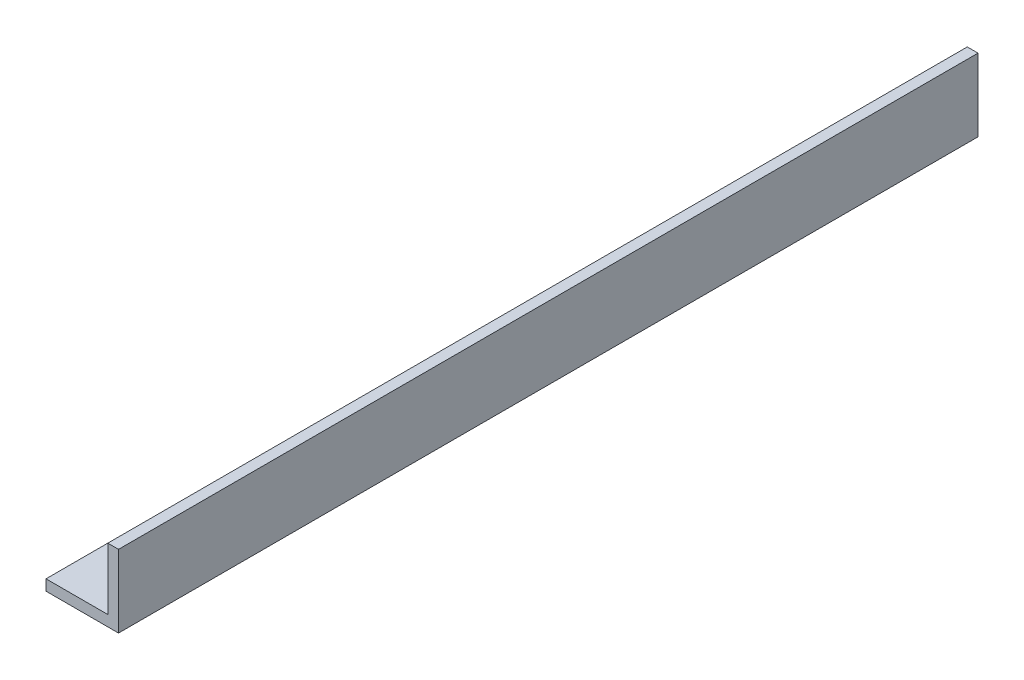
ISO-10303-21;
HEADER;
FILE_DESCRIPTION(('STEP AP214'),'2;1');
FILE_NAME('part.step','',(''),(''),'','','');
FILE_SCHEMA(('AUTOMOTIVE_DESIGN { 1 0 10303 214 1 1 1 1 }'));
ENDSEC;
DATA;
#1=APPLICATION_CONTEXT('core data for automotive mechanical design processes');
#2=APPLICATION_PROTOCOL_DEFINITION('international standard','automotive_design',2000,#1);
#3=PRODUCT_CONTEXT('',#1,'mechanical');
#4=PRODUCT('Part','Part','',(#3));
#5=PRODUCT_RELATED_PRODUCT_CATEGORY('part','',(#4));
#6=PRODUCT_DEFINITION_FORMATION('','',#4);
#7=PRODUCT_DEFINITION_CONTEXT('part definition',#1,'design');
#8=PRODUCT_DEFINITION('design','',#6,#7);
#9=PRODUCT_DEFINITION_SHAPE('','',#8);
#10=(LENGTH_UNIT() NAMED_UNIT(*) SI_UNIT(.MILLI.,.METRE.));
#11=(NAMED_UNIT(*) PLANE_ANGLE_UNIT() SI_UNIT($,.RADIAN.));
#12=(NAMED_UNIT(*) SI_UNIT($,.STERADIAN.) SOLID_ANGLE_UNIT());
#13=UNCERTAINTY_MEASURE_WITH_UNIT(LENGTH_MEASURE(1.E-05),#10,'distance_accuracy_value','');
#14=(GEOMETRIC_REPRESENTATION_CONTEXT(3) GLOBAL_UNCERTAINTY_ASSIGNED_CONTEXT((#13)) GLOBAL_UNIT_ASSIGNED_CONTEXT((#10,
#11,#12)) REPRESENTATION_CONTEXT('',''));
#15=CARTESIAN_POINT('',(0.,0.,0.));
#16=DIRECTION('',(0.,0.,1.));
#17=DIRECTION('',(1.,0.,0.));
#18=AXIS2_PLACEMENT_3D('',#15,#16,#17);
#19=CARTESIAN_POINT('',(0.,4.,320.));
#20=DIRECTION('',(1.,0.,0.));
#21=DIRECTION('',(0.,0.,-1.));
#22=AXIS2_PLACEMENT_3D('',#19,#20,#21);
#23=PLANE('',#22);
#24=DIRECTION('',(0.,-1.,0.));
#25=VECTOR('',#24,1.);
#26=CARTESIAN_POINT('',(0.,4.,0.));
#27=LINE('',#26,#25);
#28=CARTESIAN_POINT('',(0.,4.,0.));
#29=VERTEX_POINT('',#28);
#30=CARTESIAN_POINT('',(0.,0.,0.));
#31=VERTEX_POINT('',#30);
#32=EDGE_CURVE('E117',#29,#31,#27,.T.);
#33=ORIENTED_EDGE('',*,*,#32,.T.);
#34=DIRECTION('',(0.,0.,-1.));
#35=VECTOR('',#34,1.);
#36=CARTESIAN_POINT('',(0.,0.,320.));
#37=LINE('',#36,#35);
#38=CARTESIAN_POINT('',(0.,0.,320.));
#39=VERTEX_POINT('',#38);
#40=EDGE_CURVE('E11',#39,#31,#37,.T.);
#41=ORIENTED_EDGE('',*,*,#40,.F.);
#42=DIRECTION('',(0.,-1.,0.));
#43=VECTOR('',#42,1.);
#44=CARTESIAN_POINT('',(0.,4.,320.));
#45=LINE('',#44,#43);
#46=CARTESIAN_POINT('',(0.,4.,320.));
#47=VERTEX_POINT('',#46);
#48=EDGE_CURVE('E127',#47,#39,#45,.T.);
#49=ORIENTED_EDGE('',*,*,#48,.F.);
#50=DIRECTION('',(0.,0.,-1.));
#51=VECTOR('',#50,1.);
#52=CARTESIAN_POINT('',(0.,4.,320.));
#53=LINE('',#52,#51);
#54=EDGE_CURVE('E113',#47,#29,#53,.T.);
#55=ORIENTED_EDGE('',*,*,#54,.T.);
#56=EDGE_LOOP('',(#33,#41,#49,#55));
#57=FACE_BOUND('',#56,.T.);
#58=ADVANCED_FACE('F33',(#57),#23,.F.);
#59=CARTESIAN_POINT('',(0.,0.,320.));
#60=DIRECTION('',(0.,1.,0.));
#61=DIRECTION('',(0.,0.,1.));
#62=AXIS2_PLACEMENT_3D('',#59,#60,#61);
#63=PLANE('',#62);
#64=DIRECTION('',(1.,0.,0.));
#65=VECTOR('',#64,1.);
#66=CARTESIAN_POINT('',(0.,0.,0.));
#67=LINE('',#66,#65);
#68=CARTESIAN_POINT('',(27.,0.,0.));
#69=VERTEX_POINT('',#68);
#70=EDGE_CURVE('E120',#31,#69,#67,.T.);
#71=ORIENTED_EDGE('',*,*,#70,.T.);
#72=DIRECTION('',(0.,0.,-1.));
#73=VECTOR('',#72,1.);
#74=CARTESIAN_POINT('',(27.,0.,320.));
#75=LINE('',#74,#73);
#76=CARTESIAN_POINT('',(27.,0.,320.));
#77=VERTEX_POINT('',#76);
#78=EDGE_CURVE('E41',#77,#69,#75,.T.);
#79=ORIENTED_EDGE('',*,*,#78,.F.);
#80=DIRECTION('',(1.,0.,0.));
#81=VECTOR('',#80,1.);
#82=CARTESIAN_POINT('',(0.,0.,320.));
#83=LINE('',#82,#81);
#84=EDGE_CURVE('E86',#39,#77,#83,.T.);
#85=ORIENTED_EDGE('',*,*,#84,.F.);
#86=ORIENTED_EDGE('',*,*,#40,.T.);
#87=EDGE_LOOP('',(#71,#79,#85,#86));
#88=FACE_BOUND('',#87,.T.);
#89=ADVANCED_FACE('F151',(#88),#63,.F.);
#90=CARTESIAN_POINT('',(27.,0.,320.));
#91=DIRECTION('',(-1.,0.,0.));
#92=DIRECTION('',(0.,0.,1.));
#93=AXIS2_PLACEMENT_3D('',#90,#91,#92);
#94=PLANE('',#93);
#95=DIRECTION('',(0.,1.,0.));
#96=VECTOR('',#95,1.);
#97=CARTESIAN_POINT('',(27.,0.,0.));
#98=LINE('',#97,#96);
#99=CARTESIAN_POINT('',(27.,27.,0.));
#100=VERTEX_POINT('',#99);
#101=EDGE_CURVE('E122',#69,#100,#98,.T.);
#102=ORIENTED_EDGE('',*,*,#101,.T.);
#103=DIRECTION('',(0.,0.,-1.));
#104=VECTOR('',#103,1.);
#105=CARTESIAN_POINT('',(27.,27.,320.));
#106=LINE('',#105,#104);
#107=CARTESIAN_POINT('',(27.,27.,320.));
#108=VERTEX_POINT('',#107);
#109=EDGE_CURVE('E108',#108,#100,#106,.T.);
#110=ORIENTED_EDGE('',*,*,#109,.F.);
#111=DIRECTION('',(0.,1.,0.));
#112=VECTOR('',#111,1.);
#113=CARTESIAN_POINT('',(27.,0.,320.));
#114=LINE('',#113,#112);
#115=EDGE_CURVE('E99',#77,#108,#114,.T.);
#116=ORIENTED_EDGE('',*,*,#115,.F.);
#117=ORIENTED_EDGE('',*,*,#78,.T.);
#118=EDGE_LOOP('',(#102,#110,#116,#117));
#119=FACE_BOUND('',#118,.T.);
#120=ADVANCED_FACE('F133',(#119),#94,.F.);
#121=CARTESIAN_POINT('',(23.,27.,320.));
#122=DIRECTION('',(0.,-1.,0.));
#123=DIRECTION('',(0.,0.,-1.));
#124=AXIS2_PLACEMENT_3D('',#121,#122,#123);
#125=PLANE('',#124);
#126=DIRECTION('',(-1.,0.,0.));
#127=VECTOR('',#126,1.);
#128=CARTESIAN_POINT('',(23.,27.,0.));
#129=LINE('',#128,#127);
#130=CARTESIAN_POINT('',(23.,27.,0.));
#131=VERTEX_POINT('',#130);
#132=EDGE_CURVE('E107',#100,#131,#129,.T.);
#133=ORIENTED_EDGE('',*,*,#132,.T.);
#134=DIRECTION('',(0.,0.,-1.));
#135=VECTOR('',#134,1.);
#136=CARTESIAN_POINT('',(23.,27.,320.));
#137=LINE('',#136,#135);
#138=CARTESIAN_POINT('',(23.,27.,320.));
#139=VERTEX_POINT('',#138);
#140=EDGE_CURVE('E104',#139,#131,#137,.T.);
#141=ORIENTED_EDGE('',*,*,#140,.F.);
#142=DIRECTION('',(-1.,0.,0.));
#143=VECTOR('',#142,1.);
#144=CARTESIAN_POINT('',(23.,27.,320.));
#145=LINE('',#144,#143);
#146=EDGE_CURVE('E93',#108,#139,#145,.T.);
#147=ORIENTED_EDGE('',*,*,#146,.F.);
#148=ORIENTED_EDGE('',*,*,#109,.T.);
#149=EDGE_LOOP('',(#133,#141,#147,#148));
#150=FACE_BOUND('',#149,.T.);
#151=ADVANCED_FACE('F105',(#150),#125,.F.);
#152=CARTESIAN_POINT('',(23.,4.,320.));
#153=DIRECTION('',(1.,0.,0.));
#154=DIRECTION('',(0.,0.,-1.));
#155=AXIS2_PLACEMENT_3D('',#152,#153,#154);
#156=PLANE('',#155);
#157=DIRECTION('',(0.,-1.,0.));
#158=VECTOR('',#157,1.);
#159=CARTESIAN_POINT('',(23.,4.,0.));
#160=LINE('',#159,#158);
#161=CARTESIAN_POINT('',(23.,4.,0.));
#162=VERTEX_POINT('',#161);
#163=EDGE_CURVE('E72',#131,#162,#160,.T.);
#164=ORIENTED_EDGE('',*,*,#163,.T.);
#165=DIRECTION('',(0.,0.,-1.));
#166=VECTOR('',#165,1.);
#167=CARTESIAN_POINT('',(23.,4.,320.));
#168=LINE('',#167,#166);
#169=CARTESIAN_POINT('',(23.,4.,320.));
#170=VERTEX_POINT('',#169);
#171=EDGE_CURVE('E109',#170,#162,#168,.T.);
#172=ORIENTED_EDGE('',*,*,#171,.F.);
#173=DIRECTION('',(0.,-1.,0.));
#174=VECTOR('',#173,1.);
#175=CARTESIAN_POINT('',(23.,4.,320.));
#176=LINE('',#175,#174);
#177=EDGE_CURVE('E97',#139,#170,#176,.T.);
#178=ORIENTED_EDGE('',*,*,#177,.F.);
#179=ORIENTED_EDGE('',*,*,#140,.T.);
#180=EDGE_LOOP('',(#164,#172,#178,#179));
#181=FACE_BOUND('',#180,.T.);
#182=ADVANCED_FACE('F111',(#181),#156,.F.);
#183=CARTESIAN_POINT('',(0.,4.,320.));
#184=DIRECTION('',(0.,-1.,0.));
#185=DIRECTION('',(0.,0.,-1.));
#186=AXIS2_PLACEMENT_3D('',#183,#184,#185);
#187=PLANE('',#186);
#188=DIRECTION('',(-1.,0.,0.));
#189=VECTOR('',#188,1.);
#190=CARTESIAN_POINT('',(0.,4.,0.));
#191=LINE('',#190,#189);
#192=EDGE_CURVE('E78',#162,#29,#191,.T.);
#193=ORIENTED_EDGE('',*,*,#192,.T.);
#194=ORIENTED_EDGE('',*,*,#54,.F.);
#195=DIRECTION('',(-1.,0.,0.));
#196=VECTOR('',#195,1.);
#197=CARTESIAN_POINT('',(0.,4.,320.));
#198=LINE('',#197,#196);
#199=EDGE_CURVE('E49',#170,#47,#198,.T.);
#200=ORIENTED_EDGE('',*,*,#199,.F.);
#201=ORIENTED_EDGE('',*,*,#171,.T.);
#202=EDGE_LOOP('',(#193,#194,#200,#201));
#203=FACE_BOUND('',#202,.T.);
#204=ADVANCED_FACE('F140',(#203),#187,.F.);
#205=CARTESIAN_POINT('',(0.,0.,320.));
#206=DIRECTION('',(0.,0.,1.));
#207=DIRECTION('',(1.,0.,0.));
#208=AXIS2_PLACEMENT_3D('',#205,#206,#207);
#209=PLANE('',#208);
#210=ORIENTED_EDGE('',*,*,#48,.T.);
#211=ORIENTED_EDGE('',*,*,#84,.T.);
#212=ORIENTED_EDGE('',*,*,#115,.T.);
#213=ORIENTED_EDGE('',*,*,#146,.T.);
#214=ORIENTED_EDGE('',*,*,#177,.T.);
#215=ORIENTED_EDGE('',*,*,#199,.T.);
#216=EDGE_LOOP('',(#210,#211,#212,#213,#214,#215));
#217=FACE_BOUND('',#216,.T.);
#218=ADVANCED_FACE('F95',(#217),#209,.T.);
#219=CARTESIAN_POINT('',(0.,0.,0.));
#220=DIRECTION('',(0.,0.,1.));
#221=DIRECTION('',(1.,0.,0.));
#222=AXIS2_PLACEMENT_3D('',#219,#220,#221);
#223=PLANE('',#222);
#224=ORIENTED_EDGE('',*,*,#32,.F.);
#225=ORIENTED_EDGE('',*,*,#192,.F.);
#226=ORIENTED_EDGE('',*,*,#163,.F.);
#227=ORIENTED_EDGE('',*,*,#132,.F.);
#228=ORIENTED_EDGE('',*,*,#101,.F.);
#229=ORIENTED_EDGE('',*,*,#70,.F.);
#230=EDGE_LOOP('',(#224,#225,#226,#227,#228,#229));
#231=FACE_BOUND('',#230,.T.);
#232=ADVANCED_FACE('F136',(#231),#223,.F.);
#233=CLOSED_SHELL('',(#58,#89,#120,#151,#182,#204,#218,#232));
#234=MANIFOLD_SOLID_BREP('B2',#233);
#235=ADVANCED_BREP_SHAPE_REPRESENTATION('',(#18,#234),#14);
#236=SHAPE_DEFINITION_REPRESENTATION(#9,#235);
ENDSEC;
END-ISO-10303-21;
